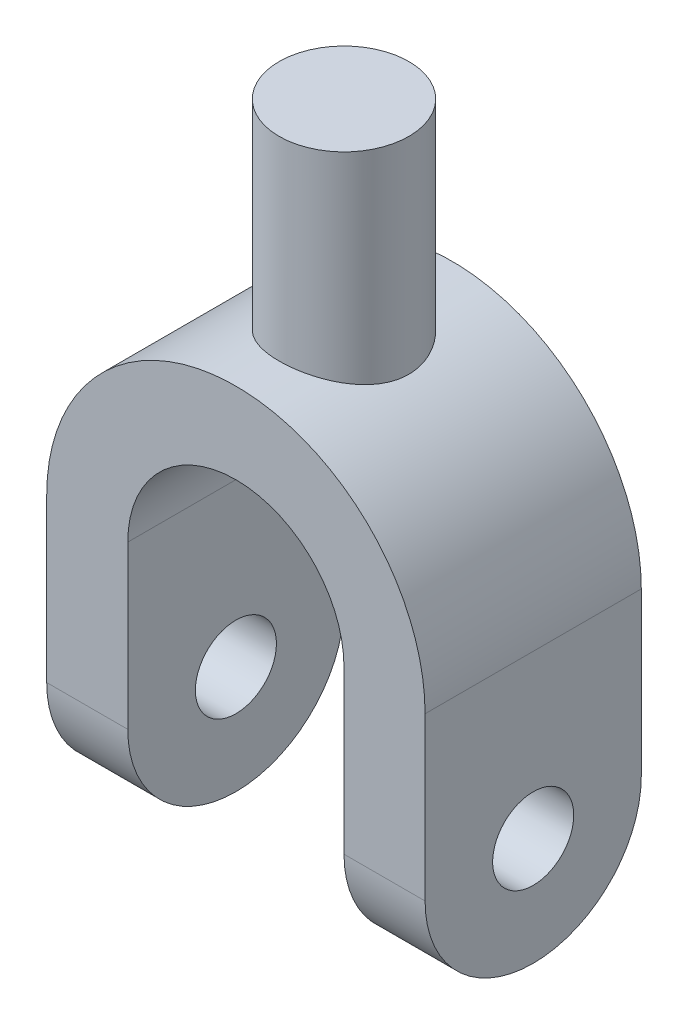
ISO-10303-21;
HEADER;
FILE_DESCRIPTION(('STEP AP214'),'2;1');
FILE_NAME('part.step','',(''),(''),'','','');
FILE_SCHEMA(('AUTOMOTIVE_DESIGN { 1 0 10303 214 1 1 1 1 }'));
ENDSEC;
DATA;
#1=APPLICATION_CONTEXT('core data for automotive mechanical design processes');
#2=APPLICATION_PROTOCOL_DEFINITION('international standard','automotive_design',2000,#1);
#3=PRODUCT_CONTEXT('',#1,'mechanical');
#4=PRODUCT('Part','Part','',(#3));
#5=PRODUCT_RELATED_PRODUCT_CATEGORY('part','',(#4));
#6=PRODUCT_DEFINITION_FORMATION('','',#4);
#7=PRODUCT_DEFINITION_CONTEXT('part definition',#1,'design');
#8=PRODUCT_DEFINITION('design','',#6,#7);
#9=PRODUCT_DEFINITION_SHAPE('','',#8);
#10=(LENGTH_UNIT() NAMED_UNIT(*) SI_UNIT(.MILLI.,.METRE.));
#11=(NAMED_UNIT(*) PLANE_ANGLE_UNIT() SI_UNIT($,.RADIAN.));
#12=(NAMED_UNIT(*) SI_UNIT($,.STERADIAN.) SOLID_ANGLE_UNIT());
#13=UNCERTAINTY_MEASURE_WITH_UNIT(LENGTH_MEASURE(1.E-05),#10,'distance_accuracy_value','');
#14=(GEOMETRIC_REPRESENTATION_CONTEXT(3) GLOBAL_UNCERTAINTY_ASSIGNED_CONTEXT((#13)) GLOBAL_UNIT_ASSIGNED_CONTEXT((#10,
#11,#12)) REPRESENTATION_CONTEXT('',''));
#15=CARTESIAN_POINT('',(0.,0.,0.));
#16=DIRECTION('',(0.,0.,1.));
#17=DIRECTION('',(1.,0.,0.));
#18=AXIS2_PLACEMENT_3D('',#15,#16,#17);
#19=CARTESIAN_POINT('',(-44.45,-38.1,0.));
#20=DIRECTION('',(1.,0.,0.));
#21=DIRECTION('',(0.,0.,-1.));
#22=AXIS2_PLACEMENT_3D('',#19,#20,#21);
#23=CYLINDRICAL_SURFACE('',#22,25.4);
#24=DIRECTION('',(-1.,0.,0.));
#25=VECTOR('',#24,1.);
#26=CARTESIAN_POINT('',(-44.45,-38.1,25.4));
#27=LINE('',#26,#25);
#28=CARTESIAN_POINT('',(-44.45,-38.1,25.4));
#29=VERTEX_POINT('',#28);
#30=CARTESIAN_POINT('',(-25.4,-38.1,25.4));
#31=VERTEX_POINT('',#30);
#32=EDGE_CURVE('E143',#29,#31,#27,.F.);
#33=ORIENTED_EDGE('',*,*,#32,.F.);
#34=CARTESIAN_POINT('',(-44.45,-38.1,0.));
#35=DIRECTION('',(1.,0.,0.));
#36=DIRECTION('',(0.,1.,0.));
#37=AXIS2_PLACEMENT_3D('',#34,#35,#36);
#38=CIRCLE('',#37,25.4);
#39=CARTESIAN_POINT('',(-44.45,-38.1,-25.4));
#40=VERTEX_POINT('',#39);
#41=EDGE_CURVE('E47',#40,#29,#38,.F.);
#42=ORIENTED_EDGE('',*,*,#41,.F.);
#43=DIRECTION('',(1.,0.,0.));
#44=VECTOR('',#43,1.);
#45=CARTESIAN_POINT('',(0.,-38.1,-25.4));
#46=LINE('',#45,#44);
#47=CARTESIAN_POINT('',(-25.4,-38.1,-25.4));
#48=VERTEX_POINT('',#47);
#49=EDGE_CURVE('E145',#48,#40,#46,.F.);
#50=ORIENTED_EDGE('',*,*,#49,.F.);
#51=CARTESIAN_POINT('',(-25.4,-38.1,0.));
#52=DIRECTION('',(-1.,0.,0.));
#53=DIRECTION('',(0.,0.,1.));
#54=AXIS2_PLACEMENT_3D('',#51,#52,#53);
#55=CIRCLE('',#54,25.4);
#56=EDGE_CURVE('E11',#31,#48,#55,.F.);
#57=ORIENTED_EDGE('',*,*,#56,.F.);
#58=EDGE_LOOP('',(#33,#42,#50,#57));
#59=FACE_BOUND('',#58,.T.);
#60=ADVANCED_FACE('F38',(#59),#23,.T.);
#61=CARTESIAN_POINT('',(25.4,-38.1,0.));
#62=DIRECTION('',(1.,0.,0.));
#63=DIRECTION('',(0.,1.,0.));
#64=AXIS2_PLACEMENT_3D('',#61,#62,#63);
#65=CYLINDRICAL_SURFACE('',#64,25.4);
#66=DIRECTION('',(-1.,0.,0.));
#67=VECTOR('',#66,1.);
#68=CARTESIAN_POINT('',(25.4,-38.1,25.4));
#69=LINE('',#68,#67);
#70=CARTESIAN_POINT('',(25.4,-38.1,25.4));
#71=VERTEX_POINT('',#70);
#72=CARTESIAN_POINT('',(44.45,-38.1,25.4));
#73=VERTEX_POINT('',#72);
#74=EDGE_CURVE('E128',#71,#73,#69,.F.);
#75=ORIENTED_EDGE('',*,*,#74,.F.);
#76=CARTESIAN_POINT('',(25.4,-38.1,0.));
#77=DIRECTION('',(1.,0.,0.));
#78=DIRECTION('',(0.,0.,-1.));
#79=AXIS2_PLACEMENT_3D('',#76,#77,#78);
#80=CIRCLE('',#79,25.4);
#81=CARTESIAN_POINT('',(25.4,-38.1,-25.4));
#82=VERTEX_POINT('',#81);
#83=EDGE_CURVE('E108',#82,#71,#80,.F.);
#84=ORIENTED_EDGE('',*,*,#83,.F.);
#85=DIRECTION('',(1.,0.,0.));
#86=VECTOR('',#85,1.);
#87=CARTESIAN_POINT('',(0.,-38.1,-25.4));
#88=LINE('',#87,#86);
#89=CARTESIAN_POINT('',(44.45,-38.1,-25.4));
#90=VERTEX_POINT('',#89);
#91=EDGE_CURVE('E131',#90,#82,#88,.F.);
#92=ORIENTED_EDGE('',*,*,#91,.F.);
#93=CARTESIAN_POINT('',(44.45,-38.1,0.));
#94=DIRECTION('',(-1.,0.,0.));
#95=DIRECTION('',(0.,-1.,0.));
#96=AXIS2_PLACEMENT_3D('',#93,#94,#95);
#97=CIRCLE('',#96,25.4);
#98=EDGE_CURVE('E141',#73,#90,#97,.F.);
#99=ORIENTED_EDGE('',*,*,#98,.F.);
#100=EDGE_LOOP('',(#75,#84,#92,#99));
#101=FACE_BOUND('',#100,.T.);
#102=ADVANCED_FACE('F195',(#101),#65,.T.);
#103=CARTESIAN_POINT('',(0.,0.,25.4));
#104=DIRECTION('',(0.,0.,-1.));
#105=DIRECTION('',(-1.,0.,0.));
#106=AXIS2_PLACEMENT_3D('',#103,#104,#105);
#107=CYLINDRICAL_SURFACE('',#106,25.4);
#108=CARTESIAN_POINT('',(0.,0.,-25.4));
#109=DIRECTION('',(0.,0.,-1.));
#110=DIRECTION('',(1.,0.,0.));
#111=AXIS2_PLACEMENT_3D('',#108,#109,#110);
#112=CIRCLE('',#111,25.4);
#113=CARTESIAN_POINT('',(-25.4,0.,-25.4));
#114=VERTEX_POINT('',#113);
#115=CARTESIAN_POINT('',(25.4,0.,-25.4));
#116=VERTEX_POINT('',#115);
#117=EDGE_CURVE('E127',#114,#116,#112,.T.);
#118=ORIENTED_EDGE('',*,*,#117,.T.);
#119=DIRECTION('',(0.,0.,-1.));
#120=VECTOR('',#119,1.);
#121=CARTESIAN_POINT('',(25.4,0.,25.4));
#122=LINE('',#121,#120);
#123=CARTESIAN_POINT('',(25.4,0.,25.4));
#124=VERTEX_POINT('',#123);
#125=EDGE_CURVE('E106',#124,#116,#122,.T.);
#126=ORIENTED_EDGE('',*,*,#125,.F.);
#127=CARTESIAN_POINT('',(0.,0.,25.4));
#128=DIRECTION('',(0.,0.,-1.));
#129=DIRECTION('',(1.,0.,0.));
#130=AXIS2_PLACEMENT_3D('',#127,#128,#129);
#131=CIRCLE('',#130,25.4);
#132=CARTESIAN_POINT('',(-25.4,0.,25.4));
#133=VERTEX_POINT('',#132);
#134=EDGE_CURVE('E113',#133,#124,#131,.T.);
#135=ORIENTED_EDGE('',*,*,#134,.F.);
#136=DIRECTION('',(0.,0.,-1.));
#137=VECTOR('',#136,1.);
#138=CARTESIAN_POINT('',(-25.4,0.,25.4));
#139=LINE('',#138,#137);
#140=EDGE_CURVE('E159',#133,#114,#139,.T.);
#141=ORIENTED_EDGE('',*,*,#140,.T.);
#142=EDGE_LOOP('',(#118,#126,#135,#141));
#143=FACE_BOUND('',#142,.T.);
#144=ADVANCED_FACE('F125',(#143),#107,.F.);
#145=CARTESIAN_POINT('',(25.4,-63.5,25.4));
#146=DIRECTION('',(1.,0.,0.));
#147=DIRECTION('',(0.,0.,-1.));
#148=AXIS2_PLACEMENT_3D('',#145,#146,#147);
#149=PLANE('',#148);
#150=CARTESIAN_POINT('',(25.4,-38.1,0.));
#151=DIRECTION('',(1.,0.,0.));
#152=DIRECTION('',(0.,0.,-1.));
#153=AXIS2_PLACEMENT_3D('',#150,#151,#152);
#154=CIRCLE('',#153,9.52499999999998);
#155=CARTESIAN_POINT('',(25.4,-38.1,-9.52499999999998));
#156=VERTEX_POINT('',#155);
#157=EDGE_CURVE('E42',#156,#156,#154,.T.);
#158=ORIENTED_EDGE('',*,*,#157,.T.);
#159=EDGE_LOOP('',(#158));
#160=FACE_BOUND('',#159,.T.);
#161=DIRECTION('',(0.,-1.,0.));
#162=VECTOR('',#161,1.);
#163=CARTESIAN_POINT('',(25.4,-63.5,-25.4));
#164=LINE('',#163,#162);
#165=EDGE_CURVE('E165',#116,#82,#164,.T.);
#166=ORIENTED_EDGE('',*,*,#165,.T.);
#167=ORIENTED_EDGE('',*,*,#83,.T.);
#168=DIRECTION('',(0.,-1.,0.));
#169=VECTOR('',#168,1.);
#170=CARTESIAN_POINT('',(25.4,-63.5,25.4));
#171=LINE('',#170,#169);
#172=EDGE_CURVE('E101',#124,#71,#171,.T.);
#173=ORIENTED_EDGE('',*,*,#172,.F.);
#174=ORIENTED_EDGE('',*,*,#125,.T.);
#175=EDGE_LOOP('',(#166,#167,#173,#174));
#176=FACE_BOUND('',#175,.T.);
#177=ADVANCED_FACE('F104',(#160,#176),#149,.F.);
#178=CARTESIAN_POINT('',(44.45,0.,25.4));
#179=DIRECTION('',(-1.,0.,0.));
#180=DIRECTION('',(0.,-1.,0.));
#181=AXIS2_PLACEMENT_3D('',#178,#179,#180);
#182=PLANE('',#181);
#183=CARTESIAN_POINT('',(44.45,-38.1,0.));
#184=DIRECTION('',(1.,0.,0.));
#185=DIRECTION('',(0.,0.,-1.));
#186=AXIS2_PLACEMENT_3D('',#183,#184,#185);
#187=CIRCLE('',#186,9.52499999999998);
#188=CARTESIAN_POINT('',(44.45,-38.1,-9.52499999999998));
#189=VERTEX_POINT('',#188);
#190=EDGE_CURVE('E231',#189,#189,#187,.T.);
#191=ORIENTED_EDGE('',*,*,#190,.F.);
#192=EDGE_LOOP('',(#191));
#193=FACE_BOUND('',#192,.T.);
#194=DIRECTION('',(0.,1.,0.));
#195=VECTOR('',#194,1.);
#196=CARTESIAN_POINT('',(44.45,0.,25.4));
#197=LINE('',#196,#195);
#198=CARTESIAN_POINT('',(44.45,0.,25.4));
#199=VERTEX_POINT('',#198);
#200=EDGE_CURVE('E112',#73,#199,#197,.T.);
#201=ORIENTED_EDGE('',*,*,#200,.F.);
#202=ORIENTED_EDGE('',*,*,#98,.T.);
#203=DIRECTION('',(0.,1.,0.));
#204=VECTOR('',#203,1.);
#205=CARTESIAN_POINT('',(44.45,0.,-25.4));
#206=LINE('',#205,#204);
#207=CARTESIAN_POINT('',(44.45,0.,-25.4));
#208=VERTEX_POINT('',#207);
#209=EDGE_CURVE('E168',#90,#208,#206,.T.);
#210=ORIENTED_EDGE('',*,*,#209,.T.);
#211=DIRECTION('',(0.,0.,-1.));
#212=VECTOR('',#211,1.);
#213=CARTESIAN_POINT('',(44.45,0.,25.4));
#214=LINE('',#213,#212);
#215=EDGE_CURVE('E129',#199,#208,#214,.T.);
#216=ORIENTED_EDGE('',*,*,#215,.F.);
#217=EDGE_LOOP('',(#201,#202,#210,#216));
#218=FACE_BOUND('',#217,.T.);
#219=ADVANCED_FACE('F210',(#193,#218),#182,.F.);
#220=CARTESIAN_POINT('',(0.,0.,25.4));
#221=DIRECTION('',(0.,0.,-1.));
#222=DIRECTION('',(-1.,0.,0.));
#223=AXIS2_PLACEMENT_3D('',#220,#221,#222);
#224=CYLINDRICAL_SURFACE('',#223,44.45);
#225=CARTESIAN_POINT('',(0.,44.45,15.24));
#226=CARTESIAN_POINT('',(0.415087989206983,44.4500003522427,15.2400005113734));
#227=CARTESIAN_POINT('',(0.830168311489446,44.4441725287687,15.2230280791833));
#228=CARTESIAN_POINT('',(1.65723102607081,44.4210222582562,15.1553070387231));
#229=CARTESIAN_POINT('',(2.06921349468849,44.4037000953369,15.104559265318));
#230=CARTESIAN_POINT('',(2.88707834991952,44.3580324880853,14.969774828009));
#231=CARTESIAN_POINT('',(3.29296057970208,44.3296867608503,14.8857373097747));
#232=CARTESIAN_POINT('',(4.09574004779528,44.2627344897166,14.6851521431552));
#233=CARTESIAN_POINT('',(4.49263718633514,44.2241278319407,14.5686041339636));
#234=CARTESIAN_POINT('',(5.27405076802314,44.1377519965125,14.3042586771428));
#235=CARTESIAN_POINT('',(5.65858794096879,44.0899992078138,14.1565170775602));
#236=CARTESIAN_POINT('',(6.41354422403793,43.9865222095927,13.8308733865504));
#237=CARTESIAN_POINT('',(6.78396338938417,43.9307980312546,13.6529714131107));
#238=CARTESIAN_POINT('',(7.50842407545053,43.8127923934945,13.2683595450944));
#239=CARTESIAN_POINT('',(7.86246568778352,43.750510970759,13.0616498116888));
#240=CARTESIAN_POINT('',(8.55223437074116,43.6209238464875,12.620795983406));
#241=CARTESIAN_POINT('',(8.88795479518623,43.5536163423895,12.3866420285734));
#242=CARTESIAN_POINT('',(9.54968855571931,43.4134085927065,11.8844083253537));
#243=CARTESIAN_POINT('',(9.87502763643527,43.3403975169036,11.6154708471528));
#244=CARTESIAN_POINT('',(10.5020952003827,43.1927340853647,11.0517580283348));
#245=CARTESIAN_POINT('',(10.803823121947,43.1180816906389,10.7569820734202));
#246=CARTESIAN_POINT('',(11.3819754516806,42.9690854231678,10.1432749029312));
#247=CARTESIAN_POINT('',(11.6583896951914,42.8947416857033,9.82433407712047));
#248=CARTESIAN_POINT('',(12.1839667797404,42.7484252205064,9.16441095095006));
#249=CARTESIAN_POINT('',(12.4331389068608,42.6764516907185,8.82343622479046));
#250=CARTESIAN_POINT('',(12.9099769088242,42.534677510778,8.11046619394105));
#251=CARTESIAN_POINT('',(13.1367369346357,42.4650133327361,7.73783700804939));
#252=CARTESIAN_POINT('',(13.5579264120605,42.3324214681487,6.97356499197809));
#253=CARTESIAN_POINT('',(13.7523550318446,42.2694939549404,6.58192167293366));
#254=CARTESIAN_POINT('',(14.1072011999449,42.1523937671181,5.78236264058423));
#255=CARTESIAN_POINT('',(14.2676273902125,42.0982188688011,5.37445109335203));
#256=CARTESIAN_POINT('',(14.55304564564,42.0004066001561,4.54518628726864));
#257=CARTESIAN_POINT('',(14.6780394093508,41.9567687247218,4.12383367382957));
#258=CARTESIAN_POINT('',(14.8875726810196,41.8828674697644,3.28597218466087));
#259=CARTESIAN_POINT('',(14.9733862268688,41.8521857757408,2.86981875257609));
#260=CARTESIAN_POINT('',(15.1100229573102,41.8030501145937,2.03108849589172));
#261=CARTESIAN_POINT('',(15.1608469068702,41.7845958801451,1.60851181192834));
#262=CARTESIAN_POINT('',(15.2269619431617,41.7605480439074,0.760343039481046));
#263=CARTESIAN_POINT('',(15.2422631742965,41.7549507704953,0.334751846698459));
#264=CARTESIAN_POINT('',(15.2371968401551,41.7568000029928,-0.516182903258826));
#265=CARTESIAN_POINT('',(15.216830358883,41.764246112491,-0.941526467566384));
#266=CARTESIAN_POINT('',(15.1425134247326,41.7912459426944,-1.76791496171036));
#267=CARTESIAN_POINT('',(15.0902499926353,41.8101912161044,-2.16913291790054));
#268=CARTESIAN_POINT('',(14.9541529302942,41.8590615175717,-2.96548031049073));
#269=CARTESIAN_POINT('',(14.8703204794889,41.8889861354326,-3.36060997377921));
#270=CARTESIAN_POINT('',(14.6718326879105,41.9589189441254,-4.14216192978952));
#271=CARTESIAN_POINT('',(14.5571746522596,41.9989280165555,-4.52858345801374));
#272=CARTESIAN_POINT('',(14.2980057289119,42.0878638426509,-5.29022325007206));
#273=CARTESIAN_POINT('',(14.1534940080049,42.1367908452092,-5.66544120088203));
#274=CARTESIAN_POINT('',(13.8330861066839,42.243072515448,-6.40857133392704));
#275=CARTESIAN_POINT('',(13.6567051747238,42.3005545187739,-6.7762561670583));
#276=CARTESIAN_POINT('',(13.2755557849245,42.4217171670295,-7.49552436662178));
#277=CARTESIAN_POINT('',(13.0707871875224,42.4853978424335,-7.84710765388227));
#278=CARTESIAN_POINT('',(12.634229286506,42.6172585680617,-8.53222469124908));
#279=CARTESIAN_POINT('',(12.4024376158889,42.6854390122021,-8.86575685647071));
#280=CARTESIAN_POINT('',(11.9132138618338,42.8245551008824,-9.51302148275818));
#281=CARTESIAN_POINT('',(11.6557726523377,42.895491720549,-9.82674683126993));
#282=CARTESIAN_POINT('',(11.1019008267563,43.0422679245716,-10.449327724657));
#283=CARTESIAN_POINT('',(10.8041012251589,43.1181616703863,-10.7569540054756));
#284=CARTESIAN_POINT('',(10.1835371832726,43.268926682195,-11.3462003856496));
#285=CARTESIAN_POINT('',(9.86077160149103,43.3437979012527,-11.6278192946047));
#286=CARTESIAN_POINT('',(9.19215081809868,43.4905049247421,-12.1632829767511));
#287=CARTESIAN_POINT('',(8.84628875823837,43.5623398171366,-12.417119440668));
#288=CARTESIAN_POINT('',(8.13382490324999,43.7009728639769,-12.8950543117426));
#289=CARTESIAN_POINT('',(7.76723100430404,43.7677729137404,-13.1191639336673));
#290=CARTESIAN_POINT('',(7.0112598793466,43.8952536424504,-13.5384171721515));
#291=CARTESIAN_POINT('',(6.62167229454634,43.9558567913264,-13.733205518815));
#292=CARTESIAN_POINT('',(5.82617765274249,44.0683502865545,-14.0891134300001));
#293=CARTESIAN_POINT('',(5.42027036837277,44.1202405114658,-14.2502325252474));
#294=CARTESIAN_POINT('',(4.59517886041739,44.2137890412475,-14.5372852001045));
#295=CARTESIAN_POINT('',(4.17599864319658,44.2554504010277,-14.6632292864839));
#296=CARTESIAN_POINT('',(3.32743452879161,44.3273272176407,-14.878755931778));
#297=CARTESIAN_POINT('',(2.89805113258251,44.3575432352094,-14.9683402720635));
#298=CARTESIAN_POINT('',(2.05222262617791,44.4045273643838,-15.1069916069584));
#299=CARTESIAN_POINT('',(1.63607961161966,44.4218455599675,-15.157718974911));
#300=CARTESIAN_POINT('',(0.800710976564589,44.444751379664,-15.2247175901558));
#301=CARTESIAN_POINT('',(0.381485450202843,44.4503393605183,-15.2409898853024));
#302=CARTESIAN_POINT('',(-0.456800221185652,44.4496287367035,-15.2389170648152));
#303=CARTESIAN_POINT('',(-0.875860381941973,44.4433320340238,-15.2205774883624));
#304=CARTESIAN_POINT('',(-1.71070283946057,44.4190317129634,-15.1494750420797));
#305=CARTESIAN_POINT('',(-2.12648517264187,44.4010282248396,-15.0967125552601));
#306=CARTESIAN_POINT('',(-2.93884958306218,44.3545493240399,-14.9594507297725));
#307=CARTESIAN_POINT('',(-3.33562701173273,44.3264163512961,-14.8759874757179));
#308=CARTESIAN_POINT('',(-4.12049649147279,44.2603559248453,-14.677973719104));
#309=CARTESIAN_POINT('',(-4.50858877055427,44.2224287285955,-14.5634240336982));
#310=CARTESIAN_POINT('',(-5.27360718441878,44.1377356124747,-14.304188307964));
#311=CARTESIAN_POINT('',(-5.65053235801557,44.0909689343049,-14.1594996820447));
#312=CARTESIAN_POINT('',(-6.39086242742805,43.989760011491,-13.8411290898571));
#313=CARTESIAN_POINT('',(-6.75426692708386,43.9353175421675,-13.667446274867));
#314=CARTESIAN_POINT('',(-7.47505363585227,43.8185230110401,-13.2872741812093));
#315=CARTESIAN_POINT('',(-7.83200606012308,43.7559966416092,-13.0800236811985));
#316=CARTESIAN_POINT('',(-8.5272806966441,43.6258306270571,-12.6377549322476));
#317=CARTESIAN_POINT('',(-8.86560265919013,43.5581909134306,-12.4027363112641));
#318=CARTESIAN_POINT('',(-9.52170430029821,43.4194898029508,-11.9064665300801));
#319=CARTESIAN_POINT('',(-9.83948281780697,43.3484282130987,-11.6452138893392));
#320=CARTESIAN_POINT('',(-10.4528287789189,43.204631178832,-11.0979716858371));
#321=CARTESIAN_POINT('',(-10.748385819568,43.1318949710049,-10.8119706702655));
#322=CARTESIAN_POINT('',(-11.329150127629,42.9831014411732,-10.2026242335234));
#323=CARTESIAN_POINT('',(-11.6131689177848,42.9070533074314,-9.87814251618717));
#324=CARTESIAN_POINT('',(-12.1528181039758,42.7573375494316,-9.20609865060742));
#325=CARTESIAN_POINT('',(-12.4084607113686,42.6836689109385,-8.85854653414417));
#326=CARTESIAN_POINT('',(-12.8898120586493,42.5407841226914,-8.14227094218647));
#327=CARTESIAN_POINT('',(-13.1155122735161,42.4715692438619,-7.77354147983826));
#328=CARTESIAN_POINT('',(-13.535200103578,42.3396890288126,-7.0173317125655));
#329=CARTESIAN_POINT('',(-13.7291882634082,42.2770235801172,-6.62985172981777));
#330=CARTESIAN_POINT('',(-14.0837118387802,42.1602465550764,-5.8390290565003));
#331=CARTESIAN_POINT('',(-14.2442759081567,42.1061276616208,-5.43570030838838));
#332=CARTESIAN_POINT('',(-14.5307162778027,42.008138813838,-4.61567893517393));
#333=CARTESIAN_POINT('',(-14.6565924251283,41.9642689047002,-4.19898625115702));
#334=CARTESIAN_POINT('',(-14.8723762417972,41.8882803078962,-3.3555097283294));
#335=CARTESIAN_POINT('',(-14.9622985278655,41.8561568452707,-2.92873006517978));
#336=CARTESIAN_POINT('',(-15.1052963384152,41.8047643723396,-2.06828293863108));
#337=CARTESIAN_POINT('',(-15.1583738675773,41.7854946626785,-1.63461585128222));
#338=CARTESIAN_POINT('',(-15.2252372444642,41.7611760219738,-0.787601226177555));
#339=CARTESIAN_POINT('',(-15.2410002910051,41.7554116616533,-0.374429127007607));
#340=CARTESIAN_POINT('',(-15.2389014858036,41.7561778794762,0.451809210065635));
#341=CARTESIAN_POINT('',(-15.2210409091009,41.7627079914014,0.86487545138909));
#342=CARTESIAN_POINT('',(-15.1518793981276,41.7878498284735,1.68779217488765));
#343=CARTESIAN_POINT('',(-15.1005807381694,41.8064607319374,2.09764287385134));
#344=CARTESIAN_POINT('',(-14.9650516765444,41.8551657614402,2.91116412016975));
#345=CARTESIAN_POINT('',(-14.8808211911816,41.8852599166638,3.31483465181494));
#346=CARTESIAN_POINT('',(-14.6823673986654,41.9552308185974,4.10462334095893));
#347=CARTESIAN_POINT('',(-14.568822788489,41.9948850038571,4.49093223912146));
#348=CARTESIAN_POINT('',(-14.3119181705943,42.0831311576738,5.25243482027961));
#349=CARTESIAN_POINT('',(-14.1685587715001,42.1317229437808,5.62762872999237));
#350=CARTESIAN_POINT('',(-13.8531412851041,42.2364838994205,6.36464903271411));
#351=CARTESIAN_POINT('',(-13.6810828405455,42.292653163279,6.72647525924846));
#352=CARTESIAN_POINT('',(-13.3094381939249,42.4110762368644,7.43481614786704));
#353=CARTESIAN_POINT('',(-13.1098420813459,42.473332234782,7.7813252379259));
#354=CARTESIAN_POINT('',(-12.6747880990176,42.6052370249284,8.47239975739421));
#355=CARTESIAN_POINT('',(-12.4381113235239,42.6750933437799,8.8161586145856));
#356=CARTESIAN_POINT('',(-11.9377114758417,42.8177675444478,9.48273924443158));
#357=CARTESIAN_POINT('',(-11.6739876094207,42.8905855131944,9.80556040180015));
#358=CARTESIAN_POINT('',(-11.1210063276445,43.0372810459628,10.4285358576688));
#359=CARTESIAN_POINT('',(-10.8317379746373,43.1111590524218,10.7286803433937));
#360=CARTESIAN_POINT('',(-10.2295761807234,43.2579965881841,11.3042823730368));
#361=CARTESIAN_POINT('',(-9.91669043218675,43.3309564075919,11.5797478917051));
#362=CARTESIAN_POINT('',(-9.25527578065506,43.4771417529558,12.1155348076686));
#363=CARTESIAN_POINT('',(-8.90579824743013,43.550247475469,12.3747194901104));
#364=CARTESIAN_POINT('',(-8.18524017189648,43.6914077458101,12.8626893655792));
#365=CARTESIAN_POINT('',(-7.81415891587054,43.7594621265887,13.0914735534514));
#366=CARTESIAN_POINT('',(-7.05286766328418,43.888592733897,13.5168319302254));
#367=CARTESIAN_POINT('',(-6.66266027146001,43.949669906881,13.7134104893768));
#368=CARTESIAN_POINT('',(-5.86574356413536,44.0631081275375,14.0727280932645));
#369=CARTESIAN_POINT('',(-5.45903486908752,44.115469502549,14.2354684089196));
#370=CARTESIAN_POINT('',(-4.64260926478482,44.2087451779163,14.5219186588804));
#371=CARTESIAN_POINT('',(-4.23323440511868,44.2499176547942,14.6465191808638));
#372=CARTESIAN_POINT('',(-3.40455306288757,44.3213768067571,14.8610154940984));
#373=CARTESIAN_POINT('',(-2.98524673628246,44.3516636526651,14.9509118299475));
#374=CARTESIAN_POINT('',(-2.13998864915312,44.4004741377066,15.0950922682097));
#375=CARTESIAN_POINT('',(-1.71403868548261,44.4190009028548,15.1493858345267));
#376=CARTESIAN_POINT('',(-0.858723023469974,44.4437634992849,15.2218389874927));
#377=CARTESIAN_POINT('',(-0.429357410177685,44.4499996356483,15.2399994710472));
#378=CARTESIAN_POINT('',(0.,44.45,15.24));
#379=B_SPLINE_CURVE_WITH_KNOTS('',3,(#225,#226,#227,#228,#229,#230,#231,#232,#233,#234,#235,
#236,#237,#238,#239,#240,#241,#242,#243,#244,#245,#246,#247,#248,#249,#250,#251,#252,#253,#254,
#255,#256,#257,#258,#259,#260,#261,#262,#263,#264,#265,#266,#267,#268,#269,#270,#271,#272,#273,
#274,#275,#276,#277,#278,#279,#280,#281,#282,#283,#284,#285,#286,#287,#288,#289,#290,#291,#292,
#293,#294,#295,#296,#297,#298,#299,#300,#301,#302,#303,#304,#305,#306,#307,#308,#309,#310,#311,
#312,#313,#314,#315,#316,#317,#318,#319,#320,#321,#322,#323,#324,#325,#326,#327,#328,#329,#330,
#331,#332,#333,#334,#335,#336,#337,#338,#339,#340,#341,#342,#343,#344,#345,#346,#347,#348,#349,
#350,#351,#352,#353,#354,#355,#356,#357,#358,#359,#360,#361,#362,#363,#364,#365,#366,#367,#368,
#369,#370,#371,#372,#373,#374,#375,#376,#377,#378),.UNSPECIFIED.,.T.,.F.,(4,2,2,2,2,2,2,2,2,2,2,
2,2,2,2,2,2,2,2,2,2,2,2,2,2,2,2,2,2,2,2,2,2,2,2,2,2,2,2,2,2,2,2,2,2,2,2,2,2,2,2,2,2,2,2,2,2,2,2,
2,2,2,2,2,2,2,2,2,2,2,2,2,2,2,2,2,4),(0.,1.24486481752591,2.48969886539627,3.73456486210047,
4.9794446750675,6.22211431155342,7.46477908682369,8.70743691002628,9.95054256254457,
11.2342133423407,12.5179146490823,13.8021291839037,15.0859045917068,16.409466642571,
17.7330627410506,19.056322034013,20.3795178821705,21.6559314343588,22.9323170797914,
24.208338176423,25.4843204932108,26.6980484531742,27.9117310719888,29.1255198296028,
30.3393424683891,31.5734786394197,32.8076208780792,34.0418712989621,35.2765624428034,
36.579549590619,37.8825963487697,39.186031768014,40.4889740452794,41.806614200992,
43.1242727204391,44.4415372335262,45.7587372021573,47.0159111072063,48.2730467782859,
49.5299812781697,50.7869017928726,52.0048025749357,53.2226713457457,54.4406446394111,
55.6586535920071,56.9096560394693,58.1606752500451,59.4117651027366,60.6634370509109,
61.9755351836159,63.2870664630768,64.5989703562387,65.9108517158895,67.2216037505012,
68.5323615643046,69.8425859579422,71.1527390581981,72.3917446287668,73.6307032160132,
74.869577543498,76.1084550195895,77.3208840814207,78.5332883957694,79.7457078037259,
80.958564692436,82.2266346493919,83.494741853636,84.76339469417,86.0316360929165,
87.3536306088651,88.6756688240539,89.997527492021,91.3193365037883,92.6073905634503,
93.8954244094103,95.1831157321553,96.4707750910671),.UNSPECIFIED.);
#380=CARTESIAN_POINT('',(0.,44.45,15.24));
#381=VERTEX_POINT('',#380);
#382=EDGE_CURVE('E221',#381,#381,#379,.T.);
#383=ORIENTED_EDGE('',*,*,#382,.F.);
#384=EDGE_LOOP('',(#383));
#385=FACE_BOUND('',#384,.T.);
#386=CARTESIAN_POINT('',(0.,0.,-25.4));
#387=DIRECTION('',(0.,0.,1.));
#388=DIRECTION('',(1.,0.,0.));
#389=AXIS2_PLACEMENT_3D('',#386,#387,#388);
#390=CIRCLE('',#389,44.45);
#391=CARTESIAN_POINT('',(-44.45,0.,-25.4));
#392=VERTEX_POINT('',#391);
#393=EDGE_CURVE('E170',#208,#392,#390,.T.);
#394=ORIENTED_EDGE('',*,*,#393,.T.);
#395=DIRECTION('',(0.,0.,-1.));
#396=VECTOR('',#395,1.);
#397=CARTESIAN_POINT('',(-44.45,0.,25.4));
#398=LINE('',#397,#396);
#399=CARTESIAN_POINT('',(-44.45,0.,25.4));
#400=VERTEX_POINT('',#399);
#401=EDGE_CURVE('E134',#400,#392,#398,.T.);
#402=ORIENTED_EDGE('',*,*,#401,.F.);
#403=CARTESIAN_POINT('',(0.,0.,25.4));
#404=DIRECTION('',(0.,0.,1.));
#405=DIRECTION('',(1.,0.,0.));
#406=AXIS2_PLACEMENT_3D('',#403,#404,#405);
#407=CIRCLE('',#406,44.45);
#408=EDGE_CURVE('E156',#199,#400,#407,.T.);
#409=ORIENTED_EDGE('',*,*,#408,.F.);
#410=ORIENTED_EDGE('',*,*,#215,.T.);
#411=EDGE_LOOP('',(#394,#402,#409,#410));
#412=FACE_BOUND('',#411,.T.);
#413=ADVANCED_FACE('F189',(#385,#412),#224,.T.);
#414=CARTESIAN_POINT('',(-44.45,0.,25.4));
#415=DIRECTION('',(1.,0.,0.));
#416=DIRECTION('',(0.,1.,0.));
#417=AXIS2_PLACEMENT_3D('',#414,#415,#416);
#418=PLANE('',#417);
#419=CARTESIAN_POINT('',(-44.45,-38.1,0.));
#420=DIRECTION('',(1.,0.,0.));
#421=DIRECTION('',(0.,0.,-1.));
#422=AXIS2_PLACEMENT_3D('',#419,#420,#421);
#423=CIRCLE('',#422,9.52499999999998);
#424=CARTESIAN_POINT('',(-44.45,-38.1,-9.52499999999998));
#425=VERTEX_POINT('',#424);
#426=EDGE_CURVE('E228',#425,#425,#423,.T.);
#427=ORIENTED_EDGE('',*,*,#426,.T.);
#428=EDGE_LOOP('',(#427));
#429=FACE_BOUND('',#428,.T.);
#430=DIRECTION('',(0.,-1.,0.));
#431=VECTOR('',#430,1.);
#432=CARTESIAN_POINT('',(-44.45,0.,-25.4));
#433=LINE('',#432,#431);
#434=EDGE_CURVE('E154',#392,#40,#433,.T.);
#435=ORIENTED_EDGE('',*,*,#434,.T.);
#436=ORIENTED_EDGE('',*,*,#41,.T.);
#437=DIRECTION('',(0.,-1.,0.));
#438=VECTOR('',#437,1.);
#439=CARTESIAN_POINT('',(-44.45,0.,25.4));
#440=LINE('',#439,#438);
#441=EDGE_CURVE('E152',#400,#29,#440,.T.);
#442=ORIENTED_EDGE('',*,*,#441,.F.);
#443=ORIENTED_EDGE('',*,*,#401,.T.);
#444=EDGE_LOOP('',(#435,#436,#442,#443));
#445=FACE_BOUND('',#444,.T.);
#446=ADVANCED_FACE('F150',(#429,#445),#418,.F.);
#447=CARTESIAN_POINT('',(-25.4,-63.5,25.4));
#448=DIRECTION('',(-1.,0.,0.));
#449=DIRECTION('',(0.,0.,1.));
#450=AXIS2_PLACEMENT_3D('',#447,#448,#449);
#451=PLANE('',#450);
#452=CARTESIAN_POINT('',(-25.4,-38.1,0.));
#453=DIRECTION('',(-1.,0.,0.));
#454=DIRECTION('',(0.,0.,1.));
#455=AXIS2_PLACEMENT_3D('',#452,#453,#454);
#456=CIRCLE('',#455,9.52499999999998);
#457=CARTESIAN_POINT('',(-25.4,-38.1,9.52499999999998));
#458=VERTEX_POINT('',#457);
#459=EDGE_CURVE('E166',#458,#458,#456,.T.);
#460=ORIENTED_EDGE('',*,*,#459,.T.);
#461=EDGE_LOOP('',(#460));
#462=FACE_BOUND('',#461,.T.);
#463=DIRECTION('',(0.,1.,0.));
#464=VECTOR('',#463,1.);
#465=CARTESIAN_POINT('',(-25.4,-63.5,25.4));
#466=LINE('',#465,#464);
#467=EDGE_CURVE('E119',#31,#133,#466,.T.);
#468=ORIENTED_EDGE('',*,*,#467,.F.);
#469=ORIENTED_EDGE('',*,*,#56,.T.);
#470=DIRECTION('',(0.,1.,0.));
#471=VECTOR('',#470,1.);
#472=CARTESIAN_POINT('',(-25.4,-63.5,-25.4));
#473=LINE('',#472,#471);
#474=EDGE_CURVE('E123',#48,#114,#473,.T.);
#475=ORIENTED_EDGE('',*,*,#474,.T.);
#476=ORIENTED_EDGE('',*,*,#140,.F.);
#477=EDGE_LOOP('',(#468,#469,#475,#476));
#478=FACE_BOUND('',#477,.T.);
#479=ADVANCED_FACE('F180',(#462,#478),#451,.F.);
#480=CARTESIAN_POINT('',(0.,0.,25.4));
#481=DIRECTION('',(0.,0.,1.));
#482=DIRECTION('',(1.,0.,0.));
#483=AXIS2_PLACEMENT_3D('',#480,#481,#482);
#484=PLANE('',#483);
#485=ORIENTED_EDGE('',*,*,#441,.T.);
#486=ORIENTED_EDGE('',*,*,#32,.T.);
#487=ORIENTED_EDGE('',*,*,#467,.T.);
#488=ORIENTED_EDGE('',*,*,#134,.T.);
#489=ORIENTED_EDGE('',*,*,#172,.T.);
#490=ORIENTED_EDGE('',*,*,#74,.T.);
#491=ORIENTED_EDGE('',*,*,#200,.T.);
#492=ORIENTED_EDGE('',*,*,#408,.T.);
#493=EDGE_LOOP('',(#485,#486,#487,#488,#489,#490,#491,#492));
#494=FACE_BOUND('',#493,.T.);
#495=ADVANCED_FACE('F117',(#494),#484,.T.);
#496=CARTESIAN_POINT('',(0.,0.,-25.4));
#497=DIRECTION('',(0.,0.,1.));
#498=DIRECTION('',(1.,0.,0.));
#499=AXIS2_PLACEMENT_3D('',#496,#497,#498);
#500=PLANE('',#499);
#501=ORIENTED_EDGE('',*,*,#474,.F.);
#502=ORIENTED_EDGE('',*,*,#49,.T.);
#503=ORIENTED_EDGE('',*,*,#434,.F.);
#504=ORIENTED_EDGE('',*,*,#393,.F.);
#505=ORIENTED_EDGE('',*,*,#209,.F.);
#506=ORIENTED_EDGE('',*,*,#91,.T.);
#507=ORIENTED_EDGE('',*,*,#165,.F.);
#508=ORIENTED_EDGE('',*,*,#117,.F.);
#509=EDGE_LOOP('',(#501,#502,#503,#504,#505,#506,#507,#508));
#510=FACE_BOUND('',#509,.T.);
#511=ADVANCED_FACE('F178',(#510),#500,.F.);
#512=CARTESIAN_POINT('',(44.45,-38.1,0.));
#513=DIRECTION('',(1.,0.,0.));
#514=DIRECTION('',(0.,0.,-1.));
#515=AXIS2_PLACEMENT_3D('',#512,#513,#514);
#516=CYLINDRICAL_SURFACE('',#515,9.52499999999998);
#517=ORIENTED_EDGE('',*,*,#190,.T.);
#518=EDGE_LOOP('',(#517));
#519=FACE_BOUND('',#518,.T.);
#520=ORIENTED_EDGE('',*,*,#157,.F.);
#521=EDGE_LOOP('',(#520));
#522=FACE_BOUND('',#521,.T.);
#523=ADVANCED_FACE('F255',(#519,#522),#516,.F.);
#524=ORIENTED_EDGE('',*,*,#426,.F.);
#525=EDGE_LOOP('',(#524));
#526=FACE_BOUND('',#525,.T.);
#527=ORIENTED_EDGE('',*,*,#459,.F.);
#528=EDGE_LOOP('',(#527));
#529=FACE_BOUND('',#528,.T.);
#530=ADVANCED_FACE('F248',(#526,#529),#516,.F.);
#531=CARTESIAN_POINT('',(0.,90.17,0.));
#532=DIRECTION('',(0.,1.,0.));
#533=DIRECTION('',(0.,0.,1.));
#534=AXIS2_PLACEMENT_3D('',#531,#532,#533);
#535=PLANE('',#534);
#536=CARTESIAN_POINT('',(0.,90.17,0.));
#537=DIRECTION('',(0.,1.,0.));
#538=DIRECTION('',(0.,0.,1.));
#539=AXIS2_PLACEMENT_3D('',#536,#537,#538);
#540=CIRCLE('',#539,15.24);
#541=CARTESIAN_POINT('',(0.,90.17,15.24));
#542=VERTEX_POINT('',#541);
#543=EDGE_CURVE('E240',#542,#542,#540,.T.);
#544=ORIENTED_EDGE('',*,*,#543,.T.);
#545=EDGE_LOOP('',(#544));
#546=FACE_BOUND('',#545,.T.);
#547=ADVANCED_FACE('F246',(#546),#535,.T.);
#548=CARTESIAN_POINT('',(0.,-63.501,0.));
#549=DIRECTION('',(0.,1.,0.));
#550=DIRECTION('',(0.,0.,1.));
#551=AXIS2_PLACEMENT_3D('',#548,#549,#550);
#552=CYLINDRICAL_SURFACE('',#551,15.24);
#553=ORIENTED_EDGE('',*,*,#543,.F.);
#554=EDGE_LOOP('',(#553));
#555=FACE_BOUND('',#554,.T.);
#556=ORIENTED_EDGE('',*,*,#382,.T.);
#557=EDGE_LOOP('',(#556));
#558=FACE_BOUND('',#557,.T.);
#559=ADVANCED_FACE('F241',(#555,#558),#552,.T.);
#560=CLOSED_SHELL('',(#60,#102,#144,#177,#219,#413,#446,#479,#495,#511,#523,#530,#547,#559));
#561=MANIFOLD_SOLID_BREP('B2',#560);
#562=ADVANCED_BREP_SHAPE_REPRESENTATION('',(#18,#561),#14);
#563=SHAPE_DEFINITION_REPRESENTATION(#9,#562);
ENDSEC;
END-ISO-10303-21;
